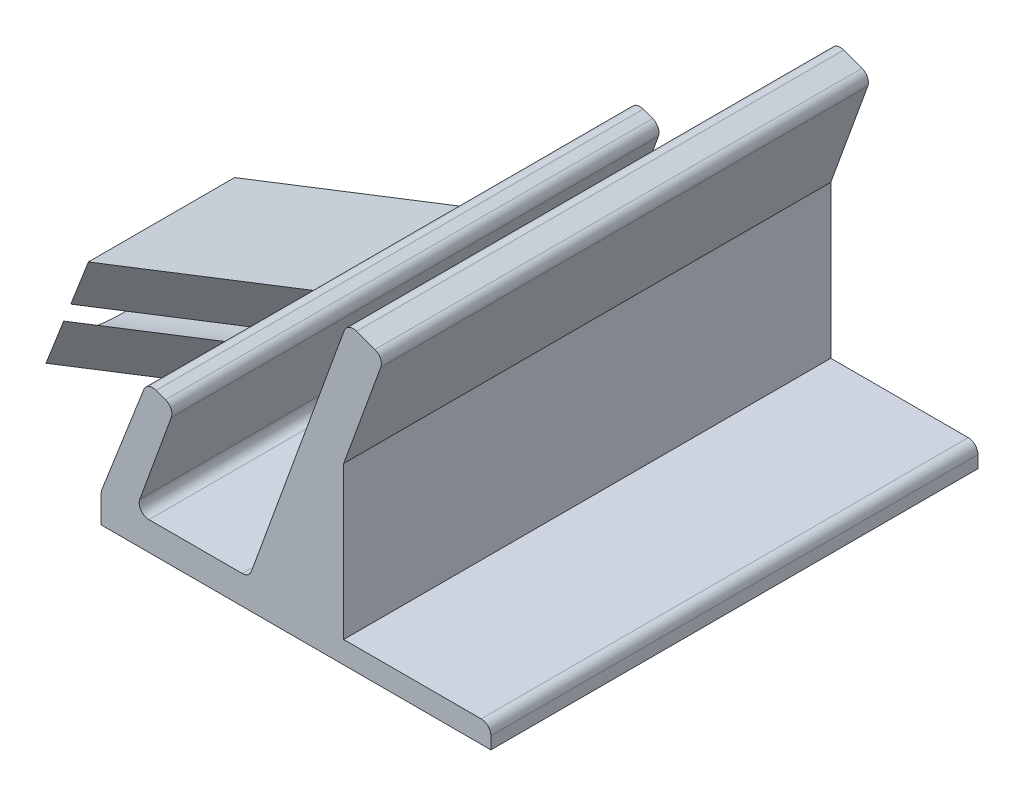
ISO-10303-21;
HEADER;
FILE_DESCRIPTION(('STEP AP214'),'2;1');
FILE_NAME('part.step','',(''),(''),'','','');
FILE_SCHEMA(('AUTOMOTIVE_DESIGN { 1 0 10303 214 1 1 1 1 }'));
ENDSEC;
DATA;
#1=APPLICATION_CONTEXT('core data for automotive mechanical design processes');
#2=APPLICATION_PROTOCOL_DEFINITION('international standard','automotive_design',2000,#1);
#3=PRODUCT_CONTEXT('',#1,'mechanical');
#4=PRODUCT('Part','Part','',(#3));
#5=PRODUCT_RELATED_PRODUCT_CATEGORY('part','',(#4));
#6=PRODUCT_DEFINITION_FORMATION('','',#4);
#7=PRODUCT_DEFINITION_CONTEXT('part definition',#1,'design');
#8=PRODUCT_DEFINITION('design','',#6,#7);
#9=PRODUCT_DEFINITION_SHAPE('','',#8);
#10=(LENGTH_UNIT() NAMED_UNIT(*) SI_UNIT(.MILLI.,.METRE.));
#11=(NAMED_UNIT(*) PLANE_ANGLE_UNIT() SI_UNIT($,.RADIAN.));
#12=(NAMED_UNIT(*) SI_UNIT($,.STERADIAN.) SOLID_ANGLE_UNIT());
#13=UNCERTAINTY_MEASURE_WITH_UNIT(LENGTH_MEASURE(1.E-05),#10,'distance_accuracy_value','');
#14=(GEOMETRIC_REPRESENTATION_CONTEXT(3) GLOBAL_UNCERTAINTY_ASSIGNED_CONTEXT((#13)) GLOBAL_UNIT_ASSIGNED_CONTEXT((#10,
#11,#12)) REPRESENTATION_CONTEXT('',''));
#15=CARTESIAN_POINT('',(0.,0.,0.));
#16=DIRECTION('',(0.,0.,1.));
#17=DIRECTION('',(1.,0.,0.));
#18=AXIS2_PLACEMENT_3D('',#15,#16,#17);
#19=CARTESIAN_POINT('',(-84.4544315510429,-3.82392509595404,32.5));
#20=DIRECTION('',(-0.71381244674496,0.278021365555668,-0.64278760968654));
#21=DIRECTION('',(-0.669169698303897,0.,0.743109625070132));
#22=AXIS2_PLACEMENT_3D('',#19,#20,#21);
#23=PLANE('',#22);
#24=DIRECTION('',(0.362931117186484,0.93181597119698,0.));
#25=VECTOR('',#24,1.);
#26=CARTESIAN_POINT('',(-84.4544315510429,-3.82392509595404,32.5));
#27=LINE('',#26,#25);
#28=CARTESIAN_POINT('',(-84.4243498751741,-3.74669119484268,32.5));
#29=VERTEX_POINT('',#28);
#30=CARTESIAN_POINT('',(-82.6415861065999,0.830507269997465,32.5));
#31=VERTEX_POINT('',#30);
#32=EDGE_CURVE('E397',#29,#31,#27,.T.);
#33=ORIENTED_EDGE('',*,*,#32,.T.);
#34=DIRECTION('',(-0.598959760793449,0.233287625297166,0.766044443118977));
#35=VECTOR('',#34,1.);
#36=CARTESIAN_POINT('',(-80.8447068242196,0.130644394105968,30.2018666706431));
#37=LINE('',#36,#35);
#38=CARTESIAN_POINT('',(-92.8239020400885,4.79639690004934,45.5227555330226));
#39=VERTEX_POINT('',#38);
#40=EDGE_CURVE('E437',#31,#39,#37,.T.);
#41=ORIENTED_EDGE('',*,*,#40,.T.);
#42=DIRECTION('',(0.362931117186484,0.93181597119698,0.));
#43=VECTOR('',#42,1.);
#44=CARTESIAN_POINT('',(-94.6367474845316,0.141964534097774,45.5227555330226));
#45=LINE('',#44,#43);
#46=CARTESIAN_POINT('',(-94.6367474845316,0.141964534097774,45.5227555330226));
#47=VERTEX_POINT('',#46);
#48=EDGE_CURVE('E399',#47,#39,#45,.T.);
#49=ORIENTED_EDGE('',*,*,#48,.F.);
#50=DIRECTION('',(-0.598959760793449,0.233287625297166,0.766044443118977));
#51=VECTOR('',#50,1.);
#52=CARTESIAN_POINT('',(-84.4544315510429,-3.82392509595404,32.5));
#53=LINE('',#52,#51);
#54=CARTESIAN_POINT('',(-84.4544315510429,-3.82392509595404,32.5));
#55=VERTEX_POINT('',#54);
#56=EDGE_CURVE('E413',#55,#47,#53,.T.);
#57=ORIENTED_EDGE('',*,*,#56,.F.);
#58=EDGE_CURVE('E394',#55,#29,#27,.T.);
#59=ORIENTED_EDGE('',*,*,#58,.T.);
#60=EDGE_LOOP('',(#33,#41,#49,#57,#59));
#61=FACE_BOUND('',#60,.T.);
#62=ADVANCED_FACE('F33',(#61),#23,.F.);
#63=CARTESIAN_POINT('',(-94.6367474845316,0.141964534097774,45.5227555330226));
#64=DIRECTION('',(0.93181597119698,-0.362931117186484,0.));
#65=DIRECTION('',(0.362931117186484,0.93181597119698,0.));
#66=AXIS2_PLACEMENT_3D('',#63,#64,#65);
#67=PLANE('',#66);
#68=ORIENTED_EDGE('',*,*,#48,.T.);
#69=CARTESIAN_POINT('',(-92.4591607814127,5.73286036127965,37.7441363987205));
#70=DIRECTION('',(0.93181597119698,-0.362931117186484,0.));
#71=DIRECTION('',(0.,0.,1.));
#72=AXIS2_PLACEMENT_3D('',#69,#70,#71);
#73=ELLIPSE('',#72,7.9341915169881,5.10000000000001);
#74=CARTESIAN_POINT('',(-93.2259305191664,3.76419949414796,30.5227555330226));
#75=VERTEX_POINT('',#74);
#76=EDGE_CURVE('E238',#39,#75,#73,.T.);
#77=ORIENTED_EDGE('',*,*,#76,.T.);
#78=DIRECTION('',(0.362931117186484,0.93181597119698,0.));
#79=VECTOR('',#78,1.);
#80=CARTESIAN_POINT('',(-94.6367474845316,0.141964534097774,30.5227555330226));
#81=LINE('',#80,#79);
#82=CARTESIAN_POINT('',(-94.6367474845316,0.141964534097774,30.5227555330226));
#83=VERTEX_POINT('',#82);
#84=EDGE_CURVE('E244',#83,#75,#81,.T.);
#85=ORIENTED_EDGE('',*,*,#84,.F.);
#86=DIRECTION('',(0.,0.,-1.));
#87=VECTOR('',#86,1.);
#88=CARTESIAN_POINT('',(-94.6367474845316,0.141964534097774,45.5227555330226));
#89=LINE('',#88,#87);
#90=EDGE_CURVE('E411',#47,#83,#89,.T.);
#91=ORIENTED_EDGE('',*,*,#90,.F.);
#92=EDGE_LOOP('',(#68,#77,#85,#91));
#93=FACE_BOUND('',#92,.T.);
#94=ADVANCED_FACE('F577',(#93),#67,.F.);
#95=CARTESIAN_POINT('',(-84.4243498751741,-3.74669119484268,50.));
#96=DIRECTION('',(0.93181597119698,-0.362931117186484,0.));
#97=DIRECTION('',(0.362931117186484,0.93181597119698,0.));
#98=AXIS2_PLACEMENT_3D('',#95,#96,#97);
#99=PLANE('',#98);
#100=CARTESIAN_POINT('',(-81.9121035892482,2.70343419245824,32.5));
#101=VERTEX_POINT('',#100);
#102=CARTESIAN_POINT('',(-80.129339820674,7.28063265729838,32.5));
#103=VERTEX_POINT('',#102);
#104=EDGE_CURVE('E398',#101,#103,#27,.T.);
#105=ORIENTED_EDGE('',*,*,#104,.F.);
#106=CARTESIAN_POINT('',(-82.2768448479241,1.76697073122784,24.721380865698));
#107=DIRECTION('',(0.93181597119698,-0.362931117186484,0.));
#108=DIRECTION('',(0.,0.,1.));
#109=AXIS2_PLACEMENT_3D('',#106,#107,#108);
#110=ELLIPSE('',#109,7.9341915169881,5.10000000000001);
#111=EDGE_CURVE('E434',#101,#31,#110,.T.);
#112=ORIENTED_EDGE('',*,*,#111,.T.);
#113=ORIENTED_EDGE('',*,*,#32,.F.);
#114=DIRECTION('',(0.,0.,-1.));
#115=VECTOR('',#114,1.);
#116=CARTESIAN_POINT('',(-84.4243498751741,-3.74669119484268,50.));
#117=LINE('',#116,#115);
#118=CARTESIAN_POINT('',(-84.4243498751741,-3.74669119484268,50.));
#119=VERTEX_POINT('',#118);
#120=EDGE_CURVE('E300',#119,#29,#117,.T.);
#121=ORIENTED_EDGE('',*,*,#120,.F.);
#122=DIRECTION('',(-0.362931117186484,-0.93181597119698,0.));
#123=VECTOR('',#122,1.);
#124=CARTESIAN_POINT('',(-84.4243498751741,-3.74669119484268,50.));
#125=LINE('',#124,#123);
#126=CARTESIAN_POINT('',(-80.1293398206741,7.28063265729839,50.));
#127=VERTEX_POINT('',#126);
#128=EDGE_CURVE('E355',#127,#119,#125,.T.);
#129=ORIENTED_EDGE('',*,*,#128,.F.);
#130=DIRECTION('',(0.,0.,-1.));
#131=VECTOR('',#130,1.);
#132=CARTESIAN_POINT('',(-80.1293398206741,7.28063265729839,50.));
#133=LINE('',#132,#131);
#134=EDGE_CURVE('E296',#127,#103,#133,.T.);
#135=ORIENTED_EDGE('',*,*,#134,.T.);
#136=EDGE_LOOP('',(#105,#112,#113,#121,#129,#135));
#137=FACE_BOUND('',#136,.T.);
#138=ADVANCED_FACE('F492',(#137),#99,.F.);
#139=DIRECTION('',(0.362931117186484,0.93181597119698,0.));
#140=VECTOR('',#139,1.);
#141=CARTESIAN_POINT('',(-84.4544315510429,-3.82392509595404,17.5));
#142=LINE('',#141,#140);
#143=CARTESIAN_POINT('',(-84.4243498751741,-3.74669119484268,17.5));
#144=VERTEX_POINT('',#143);
#145=CARTESIAN_POINT('',(-80.129339820674,7.28063265729838,17.5));
#146=VERTEX_POINT('',#145);
#147=EDGE_CURVE('E407',#144,#146,#142,.T.);
#148=ORIENTED_EDGE('',*,*,#147,.T.);
#149=CARTESIAN_POINT('',(-80.1293398206741,7.28063265729839,0.));
#150=VERTEX_POINT('',#149);
#151=EDGE_CURVE('E299',#146,#150,#133,.T.);
#152=ORIENTED_EDGE('',*,*,#151,.T.);
#153=DIRECTION('',(-0.362931117186484,-0.93181597119698,0.));
#154=VECTOR('',#153,1.);
#155=CARTESIAN_POINT('',(-84.4243498751741,-3.74669119484268,0.));
#156=LINE('',#155,#154);
#157=CARTESIAN_POINT('',(-84.4243498751741,-3.74669119484268,0.));
#158=VERTEX_POINT('',#157);
#159=EDGE_CURVE('E312',#150,#158,#156,.T.);
#160=ORIENTED_EDGE('',*,*,#159,.T.);
#161=EDGE_CURVE('E304',#144,#158,#117,.T.);
#162=ORIENTED_EDGE('',*,*,#161,.F.);
#163=EDGE_LOOP('',(#148,#152,#160,#162));
#164=FACE_BOUND('',#163,.T.);
#165=ADVANCED_FACE('F464',(#164),#99,.F.);
#166=CARTESIAN_POINT('',(-84.4925339039771,-6.92175187167785,50.));
#167=DIRECTION('',(1.,0.,0.));
#168=DIRECTION('',(0.,0.,-1.));
#169=AXIS2_PLACEMENT_3D('',#166,#167,#168);
#170=PLANE('',#169);
#171=DIRECTION('',(0.,-1.,0.));
#172=VECTOR('',#171,1.);
#173=CARTESIAN_POINT('',(-84.4925339039771,-6.92175187167785,0.));
#174=LINE('',#173,#172);
#175=CARTESIAN_POINT('',(-84.4925339039771,-4.10962231202917,0.));
#176=VERTEX_POINT('',#175);
#177=CARTESIAN_POINT('',(-84.4925339039771,-6.92175187167785,0.));
#178=VERTEX_POINT('',#177);
#179=EDGE_CURVE('E350',#176,#178,#174,.T.);
#180=ORIENTED_EDGE('',*,*,#179,.T.);
#181=DIRECTION('',(0.,0.,-1.));
#182=VECTOR('',#181,1.);
#183=CARTESIAN_POINT('',(-84.4925339039771,-6.92175187167785,50.));
#184=LINE('',#183,#182);
#185=CARTESIAN_POINT('',(-84.4925339039771,-6.92175187167785,50.));
#186=VERTEX_POINT('',#185);
#187=EDGE_CURVE('E233',#186,#178,#184,.T.);
#188=ORIENTED_EDGE('',*,*,#187,.F.);
#189=DIRECTION('',(0.,-1.,0.));
#190=VECTOR('',#189,1.);
#191=CARTESIAN_POINT('',(-84.4925339039771,-6.92175187167785,50.));
#192=LINE('',#191,#190);
#193=CARTESIAN_POINT('',(-84.4925339039771,-4.10962231202917,50.));
#194=VERTEX_POINT('',#193);
#195=EDGE_CURVE('E311',#194,#186,#192,.T.);
#196=ORIENTED_EDGE('',*,*,#195,.F.);
#197=DIRECTION('',(0.,0.,-1.));
#198=VECTOR('',#197,1.);
#199=CARTESIAN_POINT('',(-84.4925339039771,-4.10962231202917,50.));
#200=LINE('',#199,#198);
#201=EDGE_CURVE('E305',#194,#176,#200,.T.);
#202=ORIENTED_EDGE('',*,*,#201,.T.);
#203=EDGE_LOOP('',(#180,#188,#196,#202));
#204=FACE_BOUND('',#203,.T.);
#205=ADVANCED_FACE('F35',(#204),#170,.F.);
#206=CARTESIAN_POINT('',(-84.4925339039771,-6.92175187167785,50.));
#207=DIRECTION('',(0.,1.,0.));
#208=DIRECTION('',(0.,0.,1.));
#209=AXIS2_PLACEMENT_3D('',#206,#207,#208);
#210=PLANE('',#209);
#211=DIRECTION('',(1.,0.,0.));
#212=VECTOR('',#211,1.);
#213=CARTESIAN_POINT('',(-84.4925339039771,-6.92175187167785,0.));
#214=LINE('',#213,#212);
#215=CARTESIAN_POINT('',(-44.4925339039771,-6.92175187167785,0.));
#216=VERTEX_POINT('',#215);
#217=EDGE_CURVE('E348',#178,#216,#214,.T.);
#218=ORIENTED_EDGE('',*,*,#217,.T.);
#219=DIRECTION('',(0.,0.,-1.));
#220=VECTOR('',#219,1.);
#221=CARTESIAN_POINT('',(-44.4925339039771,-6.92175187167785,50.));
#222=LINE('',#221,#220);
#223=CARTESIAN_POINT('',(-44.4925339039771,-6.92175187167785,50.));
#224=VERTEX_POINT('',#223);
#225=EDGE_CURVE('E248',#224,#216,#222,.T.);
#226=ORIENTED_EDGE('',*,*,#225,.F.);
#227=DIRECTION('',(1.,0.,0.));
#228=VECTOR('',#227,1.);
#229=CARTESIAN_POINT('',(-84.4925339039771,-6.92175187167785,50.));
#230=LINE('',#229,#228);
#231=EDGE_CURVE('E389',#186,#224,#230,.T.);
#232=ORIENTED_EDGE('',*,*,#231,.F.);
#233=ORIENTED_EDGE('',*,*,#187,.T.);
#234=EDGE_LOOP('',(#218,#226,#232,#233));
#235=FACE_BOUND('',#234,.T.);
#236=ADVANCED_FACE('F569',(#235),#210,.F.);
#237=CARTESIAN_POINT('',(-44.4925339039771,-6.92175187167785,50.));
#238=DIRECTION('',(-1.,0.,0.));
#239=DIRECTION('',(0.,0.,1.));
#240=AXIS2_PLACEMENT_3D('',#237,#238,#239);
#241=PLANE('',#240);
#242=DIRECTION('',(0.,1.,0.));
#243=VECTOR('',#242,1.);
#244=CARTESIAN_POINT('',(-44.4925339039771,-6.92175187167785,0.));
#245=LINE('',#244,#243);
#246=CARTESIAN_POINT('',(-44.4925339039771,-5.66093221664552,0.));
#247=VERTEX_POINT('',#246);
#248=EDGE_CURVE('E346',#216,#247,#245,.T.);
#249=ORIENTED_EDGE('',*,*,#248,.T.);
#250=DIRECTION('',(0.,0.,-1.));
#251=VECTOR('',#250,1.);
#252=CARTESIAN_POINT('',(-44.4925339039771,-5.66093221664552,50.));
#253=LINE('',#252,#251);
#254=CARTESIAN_POINT('',(-44.4925339039771,-5.66093221664552,50.));
#255=VERTEX_POINT('',#254);
#256=EDGE_CURVE('E251',#255,#247,#253,.T.);
#257=ORIENTED_EDGE('',*,*,#256,.F.);
#258=DIRECTION('',(0.,1.,0.));
#259=VECTOR('',#258,1.);
#260=CARTESIAN_POINT('',(-44.4925339039771,-6.92175187167785,50.));
#261=LINE('',#260,#259);
#262=EDGE_CURVE('E387',#224,#255,#261,.T.);
#263=ORIENTED_EDGE('',*,*,#262,.F.);
#264=ORIENTED_EDGE('',*,*,#225,.T.);
#265=EDGE_LOOP('',(#249,#257,#263,#264));
#266=FACE_BOUND('',#265,.T.);
#267=ADVANCED_FACE('F567',(#266),#241,.F.);
#268=CARTESIAN_POINT('',(-45.4925339039771,-5.66093221664551,50.));
#269=DIRECTION('',(0.,0.,-1.));
#270=DIRECTION('',(-1.,0.,0.));
#271=AXIS2_PLACEMENT_3D('',#268,#269,#270);
#272=CYLINDRICAL_SURFACE('',#271,1.);
#273=CARTESIAN_POINT('',(-45.4925339039771,-5.66093221664551,0.));
#274=DIRECTION('',(0.,0.,1.));
#275=DIRECTION('',(1.,0.,0.));
#276=AXIS2_PLACEMENT_3D('',#273,#274,#275);
#277=CIRCLE('',#276,1.);
#278=CARTESIAN_POINT('',(-45.4925339039771,-4.66093221664551,0.));
#279=VERTEX_POINT('',#278);
#280=EDGE_CURVE('E344',#247,#279,#277,.T.);
#281=ORIENTED_EDGE('',*,*,#280,.T.);
#282=DIRECTION('',(0.,0.,-1.));
#283=VECTOR('',#282,1.);
#284=CARTESIAN_POINT('',(-45.4925339039771,-4.66093221664551,50.));
#285=LINE('',#284,#283);
#286=CARTESIAN_POINT('',(-45.4925339039771,-4.66093221664551,50.));
#287=VERTEX_POINT('',#286);
#288=EDGE_CURVE('E254',#287,#279,#285,.T.);
#289=ORIENTED_EDGE('',*,*,#288,.F.);
#290=CARTESIAN_POINT('',(-45.4925339039771,-5.66093221664551,50.));
#291=DIRECTION('',(0.,0.,1.));
#292=DIRECTION('',(1.,0.,0.));
#293=AXIS2_PLACEMENT_3D('',#290,#291,#292);
#294=CIRCLE('',#293,1.);
#295=EDGE_CURVE('E385',#255,#287,#294,.T.);
#296=ORIENTED_EDGE('',*,*,#295,.F.);
#297=ORIENTED_EDGE('',*,*,#256,.T.);
#298=EDGE_LOOP('',(#281,#289,#296,#297));
#299=FACE_BOUND('',#298,.T.);
#300=ADVANCED_FACE('F562',(#299),#272,.T.);
#301=CARTESIAN_POINT('',(-45.4925339039771,-4.66093221664551,50.));
#302=DIRECTION('',(0.,-1.,0.));
#303=DIRECTION('',(0.,0.,-1.));
#304=AXIS2_PLACEMENT_3D('',#301,#302,#303);
#305=PLANE('',#304);
#306=DIRECTION('',(-1.,0.,0.));
#307=VECTOR('',#306,1.);
#308=CARTESIAN_POINT('',(-45.4925339039771,-4.66093221664551,0.));
#309=LINE('',#308,#307);
#310=CARTESIAN_POINT('',(-59.6020973536628,-4.66093221664551,0.));
#311=VERTEX_POINT('',#310);
#312=EDGE_CURVE('E342',#279,#311,#309,.T.);
#313=ORIENTED_EDGE('',*,*,#312,.T.);
#314=DIRECTION('',(0.,0.,-1.));
#315=VECTOR('',#314,1.);
#316=CARTESIAN_POINT('',(-59.6020973536628,-4.66093221664551,50.));
#317=LINE('',#316,#315);
#318=CARTESIAN_POINT('',(-59.6020973536628,-4.66093221664551,50.));
#319=VERTEX_POINT('',#318);
#320=EDGE_CURVE('E257',#319,#311,#317,.T.);
#321=ORIENTED_EDGE('',*,*,#320,.F.);
#322=DIRECTION('',(-1.,0.,0.));
#323=VECTOR('',#322,1.);
#324=CARTESIAN_POINT('',(-45.4925339039771,-4.66093221664551,50.));
#325=LINE('',#324,#323);
#326=EDGE_CURVE('E383',#287,#319,#325,.T.);
#327=ORIENTED_EDGE('',*,*,#326,.F.);
#328=ORIENTED_EDGE('',*,*,#288,.T.);
#329=EDGE_LOOP('',(#313,#321,#327,#328));
#330=FACE_BOUND('',#329,.T.);
#331=ADVANCED_FACE('F557',(#330),#305,.F.);
#332=CARTESIAN_POINT('',(-59.6020973536628,-4.66093221664551,50.));
#333=DIRECTION('',(-1.,0.,0.));
#334=DIRECTION('',(0.,-1.,0.));
#335=AXIS2_PLACEMENT_3D('',#332,#333,#334);
#336=PLANE('',#335);
#337=DIRECTION('',(0.,1.,0.));
#338=VECTOR('',#337,1.);
#339=CARTESIAN_POINT('',(-59.6020973536628,-4.66093221664551,0.));
#340=LINE('',#339,#338);
#341=CARTESIAN_POINT('',(-59.6020973536628,10.9864032925689,0.));
#342=VERTEX_POINT('',#341);
#343=EDGE_CURVE('E340',#311,#342,#340,.T.);
#344=ORIENTED_EDGE('',*,*,#343,.T.);
#345=DIRECTION('',(0.,0.,-1.));
#346=VECTOR('',#345,1.);
#347=CARTESIAN_POINT('',(-59.6020973536628,10.9864032925689,50.));
#348=LINE('',#347,#346);
#349=CARTESIAN_POINT('',(-59.6020973536628,10.9864032925689,50.));
#350=VERTEX_POINT('',#349);
#351=EDGE_CURVE('E260',#350,#342,#348,.T.);
#352=ORIENTED_EDGE('',*,*,#351,.F.);
#353=DIRECTION('',(0.,1.,0.));
#354=VECTOR('',#353,1.);
#355=CARTESIAN_POINT('',(-59.6020973536628,-4.66093221664551,50.));
#356=LINE('',#355,#354);
#357=EDGE_CURVE('E381',#319,#350,#356,.T.);
#358=ORIENTED_EDGE('',*,*,#357,.F.);
#359=ORIENTED_EDGE('',*,*,#320,.T.);
#360=EDGE_LOOP('',(#344,#352,#358,#359));
#361=FACE_BOUND('',#360,.T.);
#362=ADVANCED_FACE('F553',(#361),#336,.F.);
#363=CARTESIAN_POINT('',(-59.6020973536628,10.9864032925689,50.));
#364=DIRECTION('',(-0.939692620785909,0.342020143325668,0.));
#365=DIRECTION('',(-0.342020143325668,-0.939692620785909,0.));
#366=AXIS2_PLACEMENT_3D('',#363,#364,#365);
#367=PLANE('',#366);
#368=DIRECTION('',(0.342020143325668,0.939692620785909,0.));
#369=VECTOR('',#368,1.);
#370=CARTESIAN_POINT('',(-59.6020973536628,10.9864032925689,0.));
#371=LINE('',#370,#369);
#372=CARTESIAN_POINT('',(-55.7977282503248,21.438821499261,0.));
#373=VERTEX_POINT('',#372);
#374=EDGE_CURVE('E338',#342,#373,#371,.T.);
#375=ORIENTED_EDGE('',*,*,#374,.T.);
#376=DIRECTION('',(0.,0.,-1.));
#377=VECTOR('',#376,1.);
#378=CARTESIAN_POINT('',(-55.7977282503248,21.438821499261,50.));
#379=LINE('',#378,#377);
#380=CARTESIAN_POINT('',(-55.7977282503248,21.438821499261,50.));
#381=VERTEX_POINT('',#380);
#382=EDGE_CURVE('E263',#381,#373,#379,.T.);
#383=ORIENTED_EDGE('',*,*,#382,.F.);
#384=DIRECTION('',(0.342020143325668,0.939692620785909,0.));
#385=VECTOR('',#384,1.);
#386=CARTESIAN_POINT('',(-59.6020973536628,10.9864032925689,50.));
#387=LINE('',#386,#385);
#388=EDGE_CURVE('E379',#350,#381,#387,.T.);
#389=ORIENTED_EDGE('',*,*,#388,.F.);
#390=ORIENTED_EDGE('',*,*,#351,.T.);
#391=EDGE_LOOP('',(#375,#383,#389,#390));
#392=FACE_BOUND('',#391,.T.);
#393=ADVANCED_FACE('F548',(#392),#367,.F.);
#394=CARTESIAN_POINT('',(-56.7374208711107,21.7808416425866,50.));
#395=DIRECTION('',(0.,0.,-1.));
#396=DIRECTION('',(-1.,0.,0.));
#397=AXIS2_PLACEMENT_3D('',#394,#395,#396);
#398=CYLINDRICAL_SURFACE('',#397,1.);
#399=CARTESIAN_POINT('',(-56.7374208711107,21.7808416425866,0.));
#400=DIRECTION('',(0.,0.,1.));
#401=DIRECTION('',(-1.,0.,0.));
#402=AXIS2_PLACEMENT_3D('',#399,#400,#401);
#403=CIRCLE('',#402,1.);
#404=CARTESIAN_POINT('',(-56.395400727785,22.7205342633726,0.));
#405=VERTEX_POINT('',#404);
#406=EDGE_CURVE('E336',#373,#405,#403,.T.);
#407=ORIENTED_EDGE('',*,*,#406,.T.);
#408=DIRECTION('',(0.,0.,-1.));
#409=VECTOR('',#408,1.);
#410=CARTESIAN_POINT('',(-56.395400727785,22.7205342633726,50.));
#411=LINE('',#410,#409);
#412=CARTESIAN_POINT('',(-56.395400727785,22.7205342633726,50.));
#413=VERTEX_POINT('',#412);
#414=EDGE_CURVE('E266',#413,#405,#411,.T.);
#415=ORIENTED_EDGE('',*,*,#414,.F.);
#416=CARTESIAN_POINT('',(-56.7374208711107,21.7808416425866,50.));
#417=DIRECTION('',(0.,0.,1.));
#418=DIRECTION('',(-1.,0.,0.));
#419=AXIS2_PLACEMENT_3D('',#416,#417,#418);
#420=CIRCLE('',#419,1.);
#421=EDGE_CURVE('E377',#381,#413,#420,.T.);
#422=ORIENTED_EDGE('',*,*,#421,.F.);
#423=ORIENTED_EDGE('',*,*,#382,.T.);
#424=EDGE_LOOP('',(#407,#415,#422,#423));
#425=FACE_BOUND('',#424,.T.);
#426=ADVANCED_FACE('F542',(#425),#398,.T.);
#427=CARTESIAN_POINT('',(-58.2747859693568,23.4045745500239,50.));
#428=DIRECTION('',(-0.342020143325669,-0.939692620785908,0.));
#429=DIRECTION('',(0.939692620785908,-0.342020143325669,0.));
#430=AXIS2_PLACEMENT_3D('',#427,#428,#429);
#431=PLANE('',#430);
#432=DIRECTION('',(-0.939692620785908,0.342020143325669,0.));
#433=VECTOR('',#432,1.);
#434=CARTESIAN_POINT('',(-58.2747859693568,23.4045745500239,0.));
#435=LINE('',#434,#433);
#436=CARTESIAN_POINT('',(-58.2747859693568,23.4045745500239,0.));
#437=VERTEX_POINT('',#436);
#438=EDGE_CURVE('E334',#405,#437,#435,.T.);
#439=ORIENTED_EDGE('',*,*,#438,.T.);
#440=DIRECTION('',(0.,0.,-1.));
#441=VECTOR('',#440,1.);
#442=CARTESIAN_POINT('',(-58.2747859693568,23.4045745500239,50.));
#443=LINE('',#442,#441);
#444=CARTESIAN_POINT('',(-58.2747859693568,23.4045745500239,50.));
#445=VERTEX_POINT('',#444);
#446=EDGE_CURVE('E269',#445,#437,#443,.T.);
#447=ORIENTED_EDGE('',*,*,#446,.F.);
#448=DIRECTION('',(-0.939692620785908,0.342020143325669,0.));
#449=VECTOR('',#448,1.);
#450=CARTESIAN_POINT('',(-58.2747859693568,23.4045745500239,50.));
#451=LINE('',#450,#449);
#452=EDGE_CURVE('E375',#413,#445,#451,.T.);
#453=ORIENTED_EDGE('',*,*,#452,.F.);
#454=ORIENTED_EDGE('',*,*,#414,.T.);
#455=EDGE_LOOP('',(#439,#447,#453,#454));
#456=FACE_BOUND('',#455,.T.);
#457=ADVANCED_FACE('F538',(#456),#431,.F.);
#458=CARTESIAN_POINT('',(-58.6168061126825,22.464881929238,50.));
#459=DIRECTION('',(0.,0.,-1.));
#460=DIRECTION('',(-1.,0.,0.));
#461=AXIS2_PLACEMENT_3D('',#458,#459,#460);
#462=CYLINDRICAL_SURFACE('',#461,0.999999999999998);
#463=CARTESIAN_POINT('',(-58.6168061126825,22.464881929238,0.));
#464=DIRECTION('',(0.,0.,1.));
#465=DIRECTION('',(-1.,0.,0.));
#466=AXIS2_PLACEMENT_3D('',#463,#464,#465);
#467=CIRCLE('',#466,0.999999999999998);
#468=CARTESIAN_POINT('',(-59.5564987334684,22.8069020725636,0.));
#469=VERTEX_POINT('',#468);
#470=EDGE_CURVE('E332',#437,#469,#467,.T.);
#471=ORIENTED_EDGE('',*,*,#470,.T.);
#472=DIRECTION('',(0.,0.,-1.));
#473=VECTOR('',#472,1.);
#474=CARTESIAN_POINT('',(-59.5564987334684,22.8069020725636,50.));
#475=LINE('',#474,#473);
#476=CARTESIAN_POINT('',(-59.5564987334684,22.8069020725636,50.));
#477=VERTEX_POINT('',#476);
#478=EDGE_CURVE('E272',#477,#469,#475,.T.);
#479=ORIENTED_EDGE('',*,*,#478,.F.);
#480=CARTESIAN_POINT('',(-58.6168061126825,22.464881929238,50.));
#481=DIRECTION('',(0.,0.,1.));
#482=DIRECTION('',(-1.,0.,0.));
#483=AXIS2_PLACEMENT_3D('',#480,#481,#482);
#484=CIRCLE('',#483,0.999999999999998);
#485=EDGE_CURVE('E373',#445,#477,#484,.T.);
#486=ORIENTED_EDGE('',*,*,#485,.F.);
#487=ORIENTED_EDGE('',*,*,#446,.T.);
#488=EDGE_LOOP('',(#471,#479,#486,#487));
#489=FACE_BOUND('',#488,.T.);
#490=ADVANCED_FACE('F533',(#489),#462,.T.);
#491=CARTESIAN_POINT('',(-69.0737024940638,-3.34140035602092,50.));
#492=DIRECTION('',(0.939692620785908,-0.34202014332567,0.));
#493=DIRECTION('',(0.34202014332567,0.939692620785908,0.));
#494=AXIS2_PLACEMENT_3D('',#491,#492,#493);
#495=PLANE('',#494);
#496=DIRECTION('',(-0.34202014332567,-0.939692620785908,0.));
#497=VECTOR('',#496,1.);
#498=CARTESIAN_POINT('',(-69.0737024940638,-3.34140035602092,0.));
#499=LINE('',#498,#497);
#500=CARTESIAN_POINT('',(-69.0737024940638,-3.34140035602092,0.));
#501=VERTEX_POINT('',#500);
#502=EDGE_CURVE('E330',#469,#501,#499,.T.);
#503=ORIENTED_EDGE('',*,*,#502,.T.);
#504=DIRECTION('',(0.,0.,-1.));
#505=VECTOR('',#504,1.);
#506=CARTESIAN_POINT('',(-69.0737024940638,-3.34140035602092,50.));
#507=LINE('',#506,#505);
#508=CARTESIAN_POINT('',(-69.0737024940638,-3.34140035602092,50.));
#509=VERTEX_POINT('',#508);
#510=EDGE_CURVE('E275',#509,#501,#507,.T.);
#511=ORIENTED_EDGE('',*,*,#510,.F.);
#512=DIRECTION('',(-0.34202014332567,-0.939692620785908,0.));
#513=VECTOR('',#512,1.);
#514=CARTESIAN_POINT('',(-69.0737024940638,-3.34140035602092,50.));
#515=LINE('',#514,#513);
#516=EDGE_CURVE('E371',#477,#509,#515,.T.);
#517=ORIENTED_EDGE('',*,*,#516,.F.);
#518=ORIENTED_EDGE('',*,*,#478,.T.);
#519=EDGE_LOOP('',(#503,#511,#517,#518));
#520=FACE_BOUND('',#519,.T.);
#521=ADVANCED_FACE('F527',(#520),#495,.F.);
#522=CARTESIAN_POINT('',(-70.0133951148497,-2.99938021269526,50.));
#523=DIRECTION('',(0.,0.,-1.));
#524=DIRECTION('',(-1.,0.,0.));
#525=AXIS2_PLACEMENT_3D('',#522,#523,#524);
#526=CYLINDRICAL_SURFACE('',#525,1.);
#527=CARTESIAN_POINT('',(-70.0133951148497,-2.99938021269526,0.));
#528=DIRECTION('',(0.,0.,-1.));
#529=DIRECTION('',(1.,0.,0.));
#530=AXIS2_PLACEMENT_3D('',#527,#528,#529);
#531=CIRCLE('',#530,1.);
#532=CARTESIAN_POINT('',(-70.0133951148497,-3.99938021269526,0.));
#533=VERTEX_POINT('',#532);
#534=EDGE_CURVE('E328',#501,#533,#531,.T.);
#535=ORIENTED_EDGE('',*,*,#534,.T.);
#536=DIRECTION('',(0.,0.,-1.));
#537=VECTOR('',#536,1.);
#538=CARTESIAN_POINT('',(-70.0133951148497,-3.99938021269526,50.));
#539=LINE('',#538,#537);
#540=CARTESIAN_POINT('',(-70.0133951148497,-3.99938021269526,50.));
#541=VERTEX_POINT('',#540);
#542=EDGE_CURVE('E278',#541,#533,#539,.T.);
#543=ORIENTED_EDGE('',*,*,#542,.F.);
#544=CARTESIAN_POINT('',(-70.0133951148497,-2.99938021269526,50.));
#545=DIRECTION('',(0.,0.,-1.));
#546=DIRECTION('',(1.,0.,0.));
#547=AXIS2_PLACEMENT_3D('',#544,#545,#546);
#548=CIRCLE('',#547,1.);
#549=EDGE_CURVE('E369',#509,#541,#548,.T.);
#550=ORIENTED_EDGE('',*,*,#549,.F.);
#551=ORIENTED_EDGE('',*,*,#510,.T.);
#552=EDGE_LOOP('',(#535,#543,#550,#551));
#553=FACE_BOUND('',#552,.T.);
#554=ADVANCED_FACE('F523',(#553),#526,.F.);
#555=CARTESIAN_POINT('',(-79.590995067133,-3.99938021269526,50.));
#556=DIRECTION('',(0.,-1.,0.));
#557=DIRECTION('',(1.,0.,0.));
#558=AXIS2_PLACEMENT_3D('',#555,#556,#557);
#559=PLANE('',#558);
#560=DIRECTION('',(-1.,0.,0.));
#561=VECTOR('',#560,1.);
#562=CARTESIAN_POINT('',(-79.590995067133,-3.99938021269526,0.));
#563=LINE('',#562,#561);
#564=CARTESIAN_POINT('',(-79.590995067133,-3.99938021269526,0.));
#565=VERTEX_POINT('',#564);
#566=EDGE_CURVE('E326',#533,#565,#563,.T.);
#567=ORIENTED_EDGE('',*,*,#566,.T.);
#568=DIRECTION('',(0.,0.,-1.));
#569=VECTOR('',#568,1.);
#570=CARTESIAN_POINT('',(-79.590995067133,-3.99938021269526,50.));
#571=LINE('',#570,#569);
#572=CARTESIAN_POINT('',(-79.590995067133,-3.99938021269526,50.));
#573=VERTEX_POINT('',#572);
#574=EDGE_CURVE('E281',#573,#565,#571,.T.);
#575=ORIENTED_EDGE('',*,*,#574,.F.);
#576=DIRECTION('',(-1.,0.,0.));
#577=VECTOR('',#576,1.);
#578=CARTESIAN_POINT('',(-79.590995067133,-3.99938021269526,50.));
#579=LINE('',#578,#577);
#580=EDGE_CURVE('E367',#541,#573,#579,.T.);
#581=ORIENTED_EDGE('',*,*,#580,.F.);
#582=ORIENTED_EDGE('',*,*,#542,.T.);
#583=EDGE_LOOP('',(#567,#575,#581,#582));
#584=FACE_BOUND('',#583,.T.);
#585=ADVANCED_FACE('F518',(#584),#559,.F.);
#586=CARTESIAN_POINT('',(-79.590995067133,-2.99938021269526,50.));
#587=DIRECTION('',(0.,0.,-1.));
#588=DIRECTION('',(-1.,0.,0.));
#589=AXIS2_PLACEMENT_3D('',#586,#587,#588);
#590=CYLINDRICAL_SURFACE('',#589,0.999999999999998);
#591=CARTESIAN_POINT('',(-79.590995067133,-2.99938021269526,0.));
#592=DIRECTION('',(0.,0.,-1.));
#593=DIRECTION('',(1.,0.,0.));
#594=AXIS2_PLACEMENT_3D('',#591,#592,#593);
#595=CIRCLE('',#594,0.999999999999998);
#596=CARTESIAN_POINT('',(-80.5306876879189,-2.65736006936958,0.));
#597=VERTEX_POINT('',#596);
#598=EDGE_CURVE('E324',#565,#597,#595,.T.);
#599=ORIENTED_EDGE('',*,*,#598,.T.);
#600=DIRECTION('',(0.,0.,-1.));
#601=VECTOR('',#600,1.);
#602=CARTESIAN_POINT('',(-80.5306876879189,-2.65736006936958,50.));
#603=LINE('',#602,#601);
#604=CARTESIAN_POINT('',(-80.5306876879189,-2.65736006936958,50.));
#605=VERTEX_POINT('',#604);
#606=EDGE_CURVE('E284',#605,#597,#603,.T.);
#607=ORIENTED_EDGE('',*,*,#606,.F.);
#608=CARTESIAN_POINT('',(-79.590995067133,-2.99938021269526,50.));
#609=DIRECTION('',(0.,0.,-1.));
#610=DIRECTION('',(1.,0.,0.));
#611=AXIS2_PLACEMENT_3D('',#608,#609,#610);
#612=CIRCLE('',#611,0.999999999999998);
#613=EDGE_CURVE('E365',#573,#605,#612,.T.);
#614=ORIENTED_EDGE('',*,*,#613,.F.);
#615=ORIENTED_EDGE('',*,*,#574,.T.);
#616=EDGE_LOOP('',(#599,#607,#614,#615));
#617=FACE_BOUND('',#616,.T.);
#618=ADVANCED_FACE('F512',(#617),#590,.F.);
#619=CARTESIAN_POINT('',(-77.2973716615207,6.22610270311999,50.));
#620=DIRECTION('',(-0.939692620785908,0.342020143325669,0.));
#621=DIRECTION('',(-0.342020143325669,-0.939692620785908,0.));
#622=AXIS2_PLACEMENT_3D('',#619,#620,#621);
#623=PLANE('',#622);
#624=DIRECTION('',(0.342020143325669,0.939692620785908,0.));
#625=VECTOR('',#624,1.);
#626=CARTESIAN_POINT('',(-77.2973716615207,6.22610270311999,0.));
#627=LINE('',#626,#625);
#628=CARTESIAN_POINT('',(-77.2973716615207,6.22610270311999,0.));
#629=VERTEX_POINT('',#628);
#630=EDGE_CURVE('E322',#597,#629,#627,.T.);
#631=ORIENTED_EDGE('',*,*,#630,.T.);
#632=DIRECTION('',(0.,0.,-1.));
#633=VECTOR('',#632,1.);
#634=CARTESIAN_POINT('',(-77.2973716615207,6.22610270311999,50.));
#635=LINE('',#634,#633);
#636=CARTESIAN_POINT('',(-77.2973716615207,6.22610270311999,50.));
#637=VERTEX_POINT('',#636);
#638=EDGE_CURVE('E287',#637,#629,#635,.T.);
#639=ORIENTED_EDGE('',*,*,#638,.F.);
#640=DIRECTION('',(0.342020143325669,0.939692620785908,0.));
#641=VECTOR('',#640,1.);
#642=CARTESIAN_POINT('',(-77.2973716615207,6.22610270311999,50.));
#643=LINE('',#642,#641);
#644=EDGE_CURVE('E363',#605,#637,#643,.T.);
#645=ORIENTED_EDGE('',*,*,#644,.F.);
#646=ORIENTED_EDGE('',*,*,#606,.T.);
#647=EDGE_LOOP('',(#631,#639,#645,#646));
#648=FACE_BOUND('',#647,.T.);
#649=ADVANCED_FACE('F508',(#648),#623,.F.);
#650=CARTESIAN_POINT('',(-78.2370642823067,6.56812284644564,50.));
#651=DIRECTION('',(0.,0.,-1.));
#652=DIRECTION('',(-1.,0.,0.));
#653=AXIS2_PLACEMENT_3D('',#650,#651,#652);
#654=CYLINDRICAL_SURFACE('',#653,1.00000000000001);
#655=CARTESIAN_POINT('',(-78.2370642823067,6.56812284644564,0.));
#656=DIRECTION('',(0.,0.,1.));
#657=DIRECTION('',(-1.,0.,0.));
#658=AXIS2_PLACEMENT_3D('',#655,#656,#657);
#659=CIRCLE('',#658,1.00000000000001);
#660=CARTESIAN_POINT('',(-77.895044138981,7.50781546723157,0.));
#661=VERTEX_POINT('',#660);
#662=EDGE_CURVE('E320',#629,#661,#659,.T.);
#663=ORIENTED_EDGE('',*,*,#662,.T.);
#664=DIRECTION('',(0.,0.,-1.));
#665=VECTOR('',#664,1.);
#666=CARTESIAN_POINT('',(-77.895044138981,7.50781546723157,50.));
#667=LINE('',#666,#665);
#668=CARTESIAN_POINT('',(-77.895044138981,7.50781546723157,50.));
#669=VERTEX_POINT('',#668);
#670=EDGE_CURVE('E290',#669,#661,#667,.T.);
#671=ORIENTED_EDGE('',*,*,#670,.F.);
#672=CARTESIAN_POINT('',(-78.2370642823067,6.56812284644564,50.));
#673=DIRECTION('',(0.,0.,1.));
#674=DIRECTION('',(-1.,0.,0.));
#675=AXIS2_PLACEMENT_3D('',#672,#673,#674);
#676=CIRCLE('',#675,1.00000000000001);
#677=EDGE_CURVE('E361',#637,#669,#676,.T.);
#678=ORIENTED_EDGE('',*,*,#677,.F.);
#679=ORIENTED_EDGE('',*,*,#638,.T.);
#680=EDGE_LOOP('',(#663,#671,#678,#679));
#681=FACE_BOUND('',#680,.T.);
#682=ADVANCED_FACE('F504',(#681),#654,.T.);
#683=CARTESIAN_POINT('',(-78.8555037061514,7.8573941608978,50.));
#684=DIRECTION('',(-0.342020143325664,-0.93969262078591,0.));
#685=DIRECTION('',(0.93969262078591,-0.342020143325664,0.));
#686=AXIS2_PLACEMENT_3D('',#683,#684,#685);
#687=PLANE('',#686);
#688=DIRECTION('',(-0.93969262078591,0.342020143325664,0.));
#689=VECTOR('',#688,1.);
#690=CARTESIAN_POINT('',(-78.8555037061514,7.8573941608978,0.));
#691=LINE('',#690,#689);
#692=CARTESIAN_POINT('',(-78.8555037061514,7.8573941608978,0.));
#693=VERTEX_POINT('',#692);
#694=EDGE_CURVE('E318',#661,#693,#691,.T.);
#695=ORIENTED_EDGE('',*,*,#694,.T.);
#696=DIRECTION('',(0.,0.,-1.));
#697=VECTOR('',#696,1.);
#698=CARTESIAN_POINT('',(-78.8555037061514,7.8573941608978,50.));
#699=LINE('',#698,#697);
#700=CARTESIAN_POINT('',(-78.8555037061514,7.8573941608978,50.));
#701=VERTEX_POINT('',#700);
#702=EDGE_CURVE('E293',#701,#693,#699,.T.);
#703=ORIENTED_EDGE('',*,*,#702,.F.);
#704=DIRECTION('',(-0.93969262078591,0.342020143325664,0.));
#705=VECTOR('',#704,1.);
#706=CARTESIAN_POINT('',(-78.8555037061514,7.8573941608978,50.));
#707=LINE('',#706,#705);
#708=EDGE_CURVE('E359',#669,#701,#707,.T.);
#709=ORIENTED_EDGE('',*,*,#708,.F.);
#710=ORIENTED_EDGE('',*,*,#670,.T.);
#711=EDGE_LOOP('',(#695,#703,#709,#710));
#712=FACE_BOUND('',#711,.T.);
#713=ADVANCED_FACE('F499',(#712),#687,.F.);
#714=CARTESIAN_POINT('',(-79.1975238494771,6.91770154011188,50.));
#715=DIRECTION('',(0.,0.,-1.));
#716=DIRECTION('',(-1.,0.,0.));
#717=AXIS2_PLACEMENT_3D('',#714,#715,#716);
#718=CYLINDRICAL_SURFACE('',#717,1.);
#719=CARTESIAN_POINT('',(-79.1975238494771,6.91770154011188,0.));
#720=DIRECTION('',(0.,0.,1.));
#721=DIRECTION('',(-1.,0.,0.));
#722=AXIS2_PLACEMENT_3D('',#719,#720,#721);
#723=CIRCLE('',#722,1.);
#724=EDGE_CURVE('E315',#693,#150,#723,.T.);
#725=ORIENTED_EDGE('',*,*,#724,.T.);
#726=ORIENTED_EDGE('',*,*,#151,.F.);
#727=DIRECTION('',(0.,0.,-1.));
#728=VECTOR('',#727,1.);
#729=CARTESIAN_POINT('',(-80.1293398206741,7.28063265729836,50.));
#730=LINE('',#729,#728);
#731=EDGE_CURVE('E353',#103,#146,#730,.T.);
#732=ORIENTED_EDGE('',*,*,#731,.F.);
#733=ORIENTED_EDGE('',*,*,#134,.F.);
#734=CARTESIAN_POINT('',(-79.1975238494771,6.91770154011188,50.));
#735=DIRECTION('',(0.,0.,1.));
#736=DIRECTION('',(-1.,0.,0.));
#737=AXIS2_PLACEMENT_3D('',#734,#735,#736);
#738=CIRCLE('',#737,1.);
#739=EDGE_CURVE('E357',#701,#127,#738,.T.);
#740=ORIENTED_EDGE('',*,*,#739,.F.);
#741=ORIENTED_EDGE('',*,*,#702,.T.);
#742=EDGE_LOOP('',(#725,#726,#732,#733,#740,#741));
#743=FACE_BOUND('',#742,.T.);
#744=ADVANCED_FACE('F467',(#743),#718,.T.);
#745=CARTESIAN_POINT('',(-83.4925339039771,-4.10962231202917,50.));
#746=DIRECTION('',(0.,0.,-1.));
#747=DIRECTION('',(-1.,0.,0.));
#748=AXIS2_PLACEMENT_3D('',#745,#746,#747);
#749=CYLINDRICAL_SURFACE('',#748,1.);
#750=CARTESIAN_POINT('',(-83.4925339039771,-4.10962231202917,0.));
#751=DIRECTION('',(0.,0.,1.));
#752=DIRECTION('',(-1.,0.,0.));
#753=AXIS2_PLACEMENT_3D('',#750,#751,#752);
#754=CIRCLE('',#753,1.);
#755=EDGE_CURVE('E309',#158,#176,#754,.T.);
#756=ORIENTED_EDGE('',*,*,#755,.T.);
#757=ORIENTED_EDGE('',*,*,#201,.F.);
#758=CARTESIAN_POINT('',(-83.4925339039771,-4.10962231202917,50.));
#759=DIRECTION('',(0.,0.,1.));
#760=DIRECTION('',(-1.,0.,0.));
#761=AXIS2_PLACEMENT_3D('',#758,#759,#760);
#762=CIRCLE('',#761,1.);
#763=EDGE_CURVE('E308',#119,#194,#762,.T.);
#764=ORIENTED_EDGE('',*,*,#763,.F.);
#765=ORIENTED_EDGE('',*,*,#120,.T.);
#766=EDGE_CURVE('E303',#29,#144,#117,.T.);
#767=ORIENTED_EDGE('',*,*,#766,.T.);
#768=ORIENTED_EDGE('',*,*,#161,.T.);
#769=EDGE_LOOP('',(#756,#757,#764,#765,#767,#768));
#770=FACE_BOUND('',#769,.T.);
#771=ADVANCED_FACE('F480',(#770),#749,.T.);
#772=CARTESIAN_POINT('',(-83.4925339039771,-4.10962231202917,50.));
#773=DIRECTION('',(0.,0.,-1.));
#774=DIRECTION('',(-1.,0.,0.));
#775=AXIS2_PLACEMENT_3D('',#772,#773,#774);
#776=PLANE('',#775);
#777=ORIENTED_EDGE('',*,*,#195,.T.);
#778=ORIENTED_EDGE('',*,*,#231,.T.);
#779=ORIENTED_EDGE('',*,*,#262,.T.);
#780=ORIENTED_EDGE('',*,*,#295,.T.);
#781=ORIENTED_EDGE('',*,*,#326,.T.);
#782=ORIENTED_EDGE('',*,*,#357,.T.);
#783=ORIENTED_EDGE('',*,*,#388,.T.);
#784=ORIENTED_EDGE('',*,*,#421,.T.);
#785=ORIENTED_EDGE('',*,*,#452,.T.);
#786=ORIENTED_EDGE('',*,*,#485,.T.);
#787=ORIENTED_EDGE('',*,*,#516,.T.);
#788=ORIENTED_EDGE('',*,*,#549,.T.);
#789=ORIENTED_EDGE('',*,*,#580,.T.);
#790=ORIENTED_EDGE('',*,*,#613,.T.);
#791=ORIENTED_EDGE('',*,*,#644,.T.);
#792=ORIENTED_EDGE('',*,*,#677,.T.);
#793=ORIENTED_EDGE('',*,*,#708,.T.);
#794=ORIENTED_EDGE('',*,*,#739,.T.);
#795=ORIENTED_EDGE('',*,*,#128,.T.);
#796=ORIENTED_EDGE('',*,*,#763,.T.);
#797=EDGE_LOOP('',(#777,#778,#779,#780,#781,#782,#783,#784,#785,#786,#787,#788,#789,#790,#791,
#792,#793,#794,#795,#796));
#798=FACE_BOUND('',#797,.T.);
#799=ADVANCED_FACE('F486',(#798),#776,.F.);
#800=CARTESIAN_POINT('',(-83.4925339039771,-4.10962231202917,0.));
#801=DIRECTION('',(0.,0.,-1.));
#802=DIRECTION('',(-1.,0.,0.));
#803=AXIS2_PLACEMENT_3D('',#800,#801,#802);
#804=PLANE('',#803);
#805=ORIENTED_EDGE('',*,*,#179,.F.);
#806=ORIENTED_EDGE('',*,*,#755,.F.);
#807=ORIENTED_EDGE('',*,*,#159,.F.);
#808=ORIENTED_EDGE('',*,*,#724,.F.);
#809=ORIENTED_EDGE('',*,*,#694,.F.);
#810=ORIENTED_EDGE('',*,*,#662,.F.);
#811=ORIENTED_EDGE('',*,*,#630,.F.);
#812=ORIENTED_EDGE('',*,*,#598,.F.);
#813=ORIENTED_EDGE('',*,*,#566,.F.);
#814=ORIENTED_EDGE('',*,*,#534,.F.);
#815=ORIENTED_EDGE('',*,*,#502,.F.);
#816=ORIENTED_EDGE('',*,*,#470,.F.);
#817=ORIENTED_EDGE('',*,*,#438,.F.);
#818=ORIENTED_EDGE('',*,*,#406,.F.);
#819=ORIENTED_EDGE('',*,*,#374,.F.);
#820=ORIENTED_EDGE('',*,*,#343,.F.);
#821=ORIENTED_EDGE('',*,*,#312,.F.);
#822=ORIENTED_EDGE('',*,*,#280,.F.);
#823=ORIENTED_EDGE('',*,*,#248,.F.);
#824=ORIENTED_EDGE('',*,*,#217,.F.);
#825=EDGE_LOOP('',(#805,#806,#807,#808,#809,#810,#811,#812,#813,#814,#815,#816,#817,#818,#819,
#820,#821,#822,#823,#824));
#826=FACE_BOUND('',#825,.T.);
#827=ADVANCED_FACE('F477',(#826),#804,.T.);
#828=CARTESIAN_POINT('',(-84.4544315510429,-3.82392509595404,17.5));
#829=DIRECTION('',(-0.93181597119698,0.362931117186484,0.));
#830=DIRECTION('',(-0.362931117186484,-0.93181597119698,0.));
#831=AXIS2_PLACEMENT_3D('',#828,#829,#830);
#832=PLANE('',#831);
#833=CARTESIAN_POINT('',(-80.0992581448051,7.35786655840972,32.5));
#834=VERTEX_POINT('',#833);
#835=EDGE_CURVE('E402',#103,#834,#27,.T.);
#836=ORIENTED_EDGE('',*,*,#835,.F.);
#837=ORIENTED_EDGE('',*,*,#731,.T.);
#838=CARTESIAN_POINT('',(-80.0992581448051,7.35786655840972,17.5));
#839=VERTEX_POINT('',#838);
#840=EDGE_CURVE('E408',#146,#839,#142,.T.);
#841=ORIENTED_EDGE('',*,*,#840,.T.);
#842=DIRECTION('',(0.,0.,1.));
#843=VECTOR('',#842,1.);
#844=CARTESIAN_POINT('',(-80.0992581448051,7.35786655840972,17.5));
#845=LINE('',#844,#843);
#846=EDGE_CURVE('E427',#839,#834,#845,.T.);
#847=ORIENTED_EDGE('',*,*,#846,.T.);
#848=EDGE_LOOP('',(#836,#837,#841,#847));
#849=FACE_BOUND('',#848,.T.);
#850=ADVANCED_FACE('F457',(#849),#832,.F.);
#851=ORIENTED_EDGE('',*,*,#766,.F.);
#852=ORIENTED_EDGE('',*,*,#58,.F.);
#853=DIRECTION('',(0.,0.,1.));
#854=VECTOR('',#853,1.);
#855=CARTESIAN_POINT('',(-84.4544315510429,-3.82392509595404,17.5));
#856=LINE('',#855,#854);
#857=CARTESIAN_POINT('',(-84.4544315510429,-3.82392509595404,17.5));
#858=VERTEX_POINT('',#857);
#859=EDGE_CURVE('E415',#858,#55,#856,.T.);
#860=ORIENTED_EDGE('',*,*,#859,.F.);
#861=EDGE_CURVE('E55',#858,#144,#142,.T.);
#862=ORIENTED_EDGE('',*,*,#861,.T.);
#863=EDGE_LOOP('',(#851,#852,#860,#862));
#864=FACE_BOUND('',#863,.T.);
#865=ADVANCED_FACE('F585',(#864),#832,.F.);
#866=CARTESIAN_POINT('',(-92.0944195227368,6.66932382250996,45.5227555330226));
#867=VERTEX_POINT('',#866);
#868=CARTESIAN_POINT('',(-90.2815740782938,11.3237561884615,45.5227555330226));
#869=VERTEX_POINT('',#868);
#870=EDGE_CURVE('E403',#867,#869,#45,.T.);
#871=ORIENTED_EDGE('',*,*,#870,.F.);
#872=DIRECTION('',(-0.598959760793449,0.233287625297166,0.766044443118977));
#873=VECTOR('',#872,1.);
#874=CARTESIAN_POINT('',(-80.1152243068678,2.00357131656671,30.2018666706431));
#875=LINE('',#874,#873);
#876=EDGE_CURVE('E431',#867,#101,#875,.F.);
#877=ORIENTED_EDGE('',*,*,#876,.T.);
#878=ORIENTED_EDGE('',*,*,#104,.T.);
#879=ORIENTED_EDGE('',*,*,#835,.T.);
#880=DIRECTION('',(-0.598959760793449,0.233287625297166,0.766044443118977));
#881=VECTOR('',#880,1.);
#882=CARTESIAN_POINT('',(-80.0992581448051,7.35786655840972,32.5));
#883=LINE('',#882,#881);
#884=EDGE_CURVE('E424',#834,#869,#883,.T.);
#885=ORIENTED_EDGE('',*,*,#884,.T.);
#886=EDGE_LOOP('',(#871,#877,#878,#879,#885));
#887=FACE_BOUND('',#886,.T.);
#888=ADVANCED_FACE('F448',(#887),#23,.F.);
#889=CARTESIAN_POINT('',(-91.692391043659,7.70152122841133,30.5227555330226));
#890=VERTEX_POINT('',#889);
#891=CARTESIAN_POINT('',(-90.2815740782938,11.3237561884615,30.5227555330226));
#892=VERTEX_POINT('',#891);
#893=EDGE_CURVE('E405',#890,#892,#81,.T.);
#894=ORIENTED_EDGE('',*,*,#893,.F.);
#895=EDGE_CURVE('E430',#890,#867,#73,.T.);
#896=ORIENTED_EDGE('',*,*,#895,.T.);
#897=ORIENTED_EDGE('',*,*,#870,.T.);
#898=DIRECTION('',(0.,0.,-1.));
#899=VECTOR('',#898,1.);
#900=CARTESIAN_POINT('',(-90.2815740782938,11.3237561884615,45.5227555330226));
#901=LINE('',#900,#899);
#902=EDGE_CURVE('E421',#869,#892,#901,.T.);
#903=ORIENTED_EDGE('',*,*,#902,.T.);
#904=EDGE_LOOP('',(#894,#896,#897,#903));
#905=FACE_BOUND('',#904,.T.);
#906=ADVANCED_FACE('F445',(#905),#67,.F.);
#907=CARTESIAN_POINT('',(-84.4544315510429,-3.82392509595404,17.5));
#908=DIRECTION('',(0.713812446744959,-0.278021365555668,0.642787609686541));
#909=DIRECTION('',(0.669169698303897,0.,-0.743109625070131));
#910=AXIS2_PLACEMENT_3D('',#907,#908,#909);
#911=PLANE('',#910);
#912=DIRECTION('',(-0.362931117186484,-0.93181597119698,0.));
#913=VECTOR('',#912,1.);
#914=CARTESIAN_POINT('',(-89.539999214778,-1.8431576367358,24.004228003145));
#915=LINE('',#914,#913);
#916=CARTESIAN_POINT('',(-86.5956427739054,5.71639905757776,24.004228003145));
#917=VERTEX_POINT('',#916);
#918=CARTESIAN_POINT('',(-88.1291822494128,1.77907732331439,24.004228003145));
#919=VERTEX_POINT('',#918);
#920=EDGE_CURVE('E229',#917,#919,#915,.T.);
#921=ORIENTED_EDGE('',*,*,#920,.F.);
#922=DIRECTION('',(-0.598959760793449,0.233287625297166,0.766044443118977));
#923=VECTOR('',#922,1.);
#924=CARTESIAN_POINT('',(-86.5956427739054,5.71639905757777,24.004228003145));
#925=LINE('',#924,#923);
#926=EDGE_CURVE('E11',#917,#890,#925,.T.);
#927=ORIENTED_EDGE('',*,*,#926,.T.);
#928=ORIENTED_EDGE('',*,*,#893,.T.);
#929=DIRECTION('',(0.598959760793449,-0.233287625297166,-0.766044443118977));
#930=VECTOR('',#929,1.);
#931=CARTESIAN_POINT('',(-80.0992581448051,7.35786655840972,17.5));
#932=LINE('',#931,#930);
#933=EDGE_CURVE('E418',#892,#839,#932,.T.);
#934=ORIENTED_EDGE('',*,*,#933,.T.);
#935=ORIENTED_EDGE('',*,*,#840,.F.);
#936=ORIENTED_EDGE('',*,*,#147,.F.);
#937=ORIENTED_EDGE('',*,*,#861,.F.);
#938=DIRECTION('',(0.598959760793449,-0.233287625297166,-0.766044443118977));
#939=VECTOR('',#938,1.);
#940=CARTESIAN_POINT('',(-84.4544315510429,-3.82392509595404,17.5));
#941=LINE('',#940,#939);
#942=EDGE_CURVE('E409',#83,#858,#941,.T.);
#943=ORIENTED_EDGE('',*,*,#942,.F.);
#944=ORIENTED_EDGE('',*,*,#84,.T.);
#945=DIRECTION('',(-0.598959760793449,0.233287625297166,0.766044443118977));
#946=VECTOR('',#945,1.);
#947=CARTESIAN_POINT('',(-88.1291822494128,1.77907732331439,24.004228003145));
#948=LINE('',#947,#946);
#949=EDGE_CURVE('E41',#75,#919,#948,.F.);
#950=ORIENTED_EDGE('',*,*,#949,.T.);
#951=EDGE_LOOP('',(#921,#927,#928,#934,#935,#936,#937,#943,#944,#950));
#952=FACE_BOUND('',#951,.T.);
#953=ADVANCED_FACE('F241',(#952),#911,.F.);
#954=CARTESIAN_POINT('',(-12.4174470689566,-31.8814644223563,0.));
#955=DIRECTION('',(-0.362931117186484,-0.93181597119698,0.));
#956=DIRECTION('',(0.93181597119698,-0.362931117186484,0.));
#957=AXIS2_PLACEMENT_3D('',#954,#955,#956);
#958=PLANE('',#957);
#959=ORIENTED_EDGE('',*,*,#859,.T.);
#960=ORIENTED_EDGE('',*,*,#56,.T.);
#961=ORIENTED_EDGE('',*,*,#90,.T.);
#962=ORIENTED_EDGE('',*,*,#942,.T.);
#963=EDGE_LOOP('',(#959,#960,#961,#962));
#964=FACE_BOUND('',#963,.T.);
#965=ADVANCED_FACE('F719',(#964),#958,.T.);
#966=CARTESIAN_POINT('',(-8.06227366271884,-20.6996727679926,0.));
#967=DIRECTION('',(-0.362931117186484,-0.93181597119698,0.));
#968=DIRECTION('',(0.93181597119698,-0.362931117186484,0.));
#969=AXIS2_PLACEMENT_3D('',#966,#967,#968);
#970=PLANE('',#969);
#971=ORIENTED_EDGE('',*,*,#846,.F.);
#972=ORIENTED_EDGE('',*,*,#933,.F.);
#973=ORIENTED_EDGE('',*,*,#902,.F.);
#974=ORIENTED_EDGE('',*,*,#884,.F.);
#975=EDGE_LOOP('',(#971,#972,#973,#974));
#976=FACE_BOUND('',#975,.T.);
#977=ADVANCED_FACE('F454',(#976),#970,.F.);
#978=CARTESIAN_POINT('',(-84.0490277992685,2.45721468311468,26.9879286222104));
#979=DIRECTION('',(-0.598959760793449,0.233287625297166,0.766044443118977));
#980=DIRECTION('',(0.787781074562735,0.,0.615955338121834));
#981=AXIS2_PLACEMENT_3D('',#978,#979,#980);
#982=CYLINDRICAL_SURFACE('',#981,5.10000000000001);
#983=CARTESIAN_POINT('',(-84.0490277992685,2.45721468311468,26.9879286222104));
#984=DIRECTION('',(-0.598959760793449,0.233287625297166,0.766044443118977));
#985=DIRECTION('',(0.787781074562735,0.,0.615955338121834));
#986=AXIS2_PLACEMENT_3D('',#983,#984,#985);
#987=CIRCLE('',#986,5.10000000000001);
#988=EDGE_CURVE('E47',#919,#917,#987,.T.);
#989=ORIENTED_EDGE('',*,*,#988,.F.);
#990=ORIENTED_EDGE('',*,*,#949,.F.);
#991=ORIENTED_EDGE('',*,*,#76,.F.);
#992=ORIENTED_EDGE('',*,*,#40,.F.);
#993=ORIENTED_EDGE('',*,*,#111,.F.);
#994=ORIENTED_EDGE('',*,*,#876,.F.);
#995=ORIENTED_EDGE('',*,*,#895,.F.);
#996=ORIENTED_EDGE('',*,*,#926,.F.);
#997=EDGE_LOOP('',(#989,#990,#991,#992,#993,#994,#995,#996));
#998=FACE_BOUND('',#997,.T.);
#999=ADVANCED_FACE('F236',(#998),#982,.F.);
#1000=CARTESIAN_POINT('',(-84.0490277992685,2.45721468311468,26.9879286222104));
#1001=DIRECTION('',(-0.598959760793449,0.233287625297166,0.766044443118977));
#1002=DIRECTION('',(0.787781074562735,0.,0.615955338121834));
#1003=AXIS2_PLACEMENT_3D('',#1000,#1001,#1002);
#1004=PLANE('',#1003);
#1005=ORIENTED_EDGE('',*,*,#920,.T.);
#1006=ORIENTED_EDGE('',*,*,#988,.T.);
#1007=EDGE_LOOP('',(#1005,#1006));
#1008=FACE_BOUND('',#1007,.T.);
#1009=ADVANCED_FACE('F230',(#1008),#1004,.T.);
#1010=CLOSED_SHELL('',(#62,#94,#138,#165,#205,#236,#267,#300,#331,#362,#393,#426,#457,#490,#521,
#554,#585,#618,#649,#682,#713,#744,#771,#799,#827,#850,#865,#888,#906,#953,#965,#977,#999,#1009));
#1011=MANIFOLD_SOLID_BREP('B2',#1010);
#1012=ADVANCED_BREP_SHAPE_REPRESENTATION('',(#18,#1011),#14);
#1013=SHAPE_DEFINITION_REPRESENTATION(#9,#1012);
ENDSEC;
END-ISO-10303-21;
